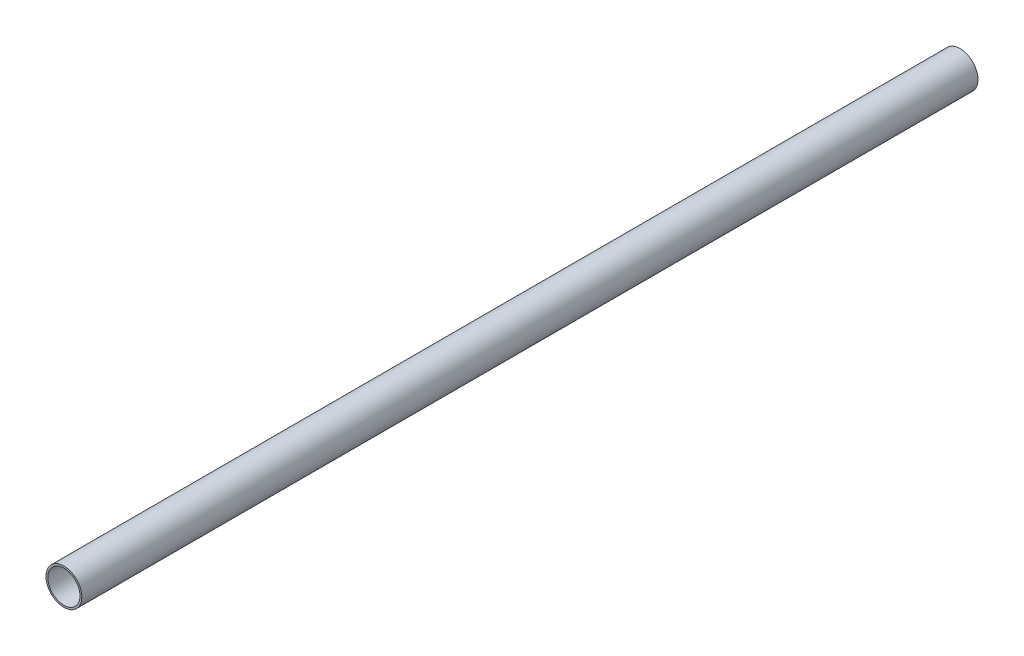
ISO-10303-21;
HEADER;
FILE_DESCRIPTION(('STEP AP214'),'2;1');
FILE_NAME('part.step','',(''),(''),'','','');
FILE_SCHEMA(('AUTOMOTIVE_DESIGN { 1 0 10303 214 1 1 1 1 }'));
ENDSEC;
DATA;
#1=APPLICATION_CONTEXT('core data for automotive mechanical design processes');
#2=APPLICATION_PROTOCOL_DEFINITION('international standard','automotive_design',2000,#1);
#3=PRODUCT_CONTEXT('',#1,'mechanical');
#4=PRODUCT('Part','Part','',(#3));
#5=PRODUCT_RELATED_PRODUCT_CATEGORY('part','',(#4));
#6=PRODUCT_DEFINITION_FORMATION('','',#4);
#7=PRODUCT_DEFINITION_CONTEXT('part definition',#1,'design');
#8=PRODUCT_DEFINITION('design','',#6,#7);
#9=PRODUCT_DEFINITION_SHAPE('','',#8);
#10=(LENGTH_UNIT() NAMED_UNIT(*) SI_UNIT(.MILLI.,.METRE.));
#11=(NAMED_UNIT(*) PLANE_ANGLE_UNIT() SI_UNIT($,.RADIAN.));
#12=(NAMED_UNIT(*) SI_UNIT($,.STERADIAN.) SOLID_ANGLE_UNIT());
#13=UNCERTAINTY_MEASURE_WITH_UNIT(LENGTH_MEASURE(1.E-05),#10,'distance_accuracy_value','');
#14=(GEOMETRIC_REPRESENTATION_CONTEXT(3) GLOBAL_UNCERTAINTY_ASSIGNED_CONTEXT((#13)) GLOBAL_UNIT_ASSIGNED_CONTEXT((#10,
#11,#12)) REPRESENTATION_CONTEXT('',''));
#15=CARTESIAN_POINT('',(0.,0.,0.));
#16=DIRECTION('',(0.,0.,1.));
#17=DIRECTION('',(1.,0.,0.));
#18=AXIS2_PLACEMENT_3D('',#15,#16,#17);
#19=CARTESIAN_POINT('',(0.,0.,1000.));
#20=DIRECTION('',(0.,0.,1.));
#21=DIRECTION('',(1.,0.,0.));
#22=AXIS2_PLACEMENT_3D('',#19,#20,#21);
#23=PLANE('',#22);
#24=CARTESIAN_POINT('',(0.,0.,1000.));
#25=DIRECTION('',(0.,0.,1.));
#26=DIRECTION('',(1.,0.,0.));
#27=AXIS2_PLACEMENT_3D('',#24,#25,#26);
#28=CIRCLE('',#27,20.);
#29=CARTESIAN_POINT('',(20.,0.,1000.));
#30=VERTEX_POINT('',#29);
#31=EDGE_CURVE('E10',#30,#30,#28,.T.);
#32=ORIENTED_EDGE('',*,*,#31,.T.);
#33=EDGE_LOOP('',(#32));
#34=FACE_BOUND('',#33,.T.);
#35=CARTESIAN_POINT('',(0.,0.,1000.));
#36=DIRECTION('',(0.,0.,1.));
#37=DIRECTION('',(1.,0.,0.));
#38=AXIS2_PLACEMENT_3D('',#35,#36,#37);
#39=CIRCLE('',#38,18.);
#40=CARTESIAN_POINT('',(18.,0.,1000.));
#41=VERTEX_POINT('',#40);
#42=EDGE_CURVE('E45',#41,#41,#39,.T.);
#43=ORIENTED_EDGE('',*,*,#42,.F.);
#44=EDGE_LOOP('',(#43));
#45=FACE_BOUND('',#44,.T.);
#46=ADVANCED_FACE('F34',(#34,#45),#23,.T.);
#47=CARTESIAN_POINT('',(0.,0.,0.));
#48=DIRECTION('',(0.,0.,1.));
#49=DIRECTION('',(1.,0.,0.));
#50=AXIS2_PLACEMENT_3D('',#47,#48,#49);
#51=PLANE('',#50);
#52=CARTESIAN_POINT('',(0.,0.,0.));
#53=DIRECTION('',(0.,0.,1.));
#54=DIRECTION('',(1.,0.,0.));
#55=AXIS2_PLACEMENT_3D('',#52,#53,#54);
#56=CIRCLE('',#55,20.);
#57=CARTESIAN_POINT('',(20.,0.,0.));
#58=VERTEX_POINT('',#57);
#59=EDGE_CURVE('E38',#58,#58,#56,.T.);
#60=ORIENTED_EDGE('',*,*,#59,.F.);
#61=EDGE_LOOP('',(#60));
#62=FACE_BOUND('',#61,.T.);
#63=CARTESIAN_POINT('',(0.,0.,0.));
#64=DIRECTION('',(0.,0.,1.));
#65=DIRECTION('',(1.,0.,0.));
#66=AXIS2_PLACEMENT_3D('',#63,#64,#65);
#67=CIRCLE('',#66,18.);
#68=CARTESIAN_POINT('',(18.,0.,0.));
#69=VERTEX_POINT('',#68);
#70=EDGE_CURVE('E47',#69,#69,#67,.T.);
#71=ORIENTED_EDGE('',*,*,#70,.T.);
#72=EDGE_LOOP('',(#71));
#73=FACE_BOUND('',#72,.T.);
#74=ADVANCED_FACE('F57',(#62,#73),#51,.F.);
#75=CARTESIAN_POINT('',(0.,0.,1000.));
#76=DIRECTION('',(0.,0.,-1.));
#77=DIRECTION('',(-1.,0.,0.));
#78=AXIS2_PLACEMENT_3D('',#75,#76,#77);
#79=CYLINDRICAL_SURFACE('',#78,20.);
#80=ORIENTED_EDGE('',*,*,#31,.F.);
#81=EDGE_LOOP('',(#80));
#82=FACE_BOUND('',#81,.T.);
#83=ORIENTED_EDGE('',*,*,#59,.T.);
#84=EDGE_LOOP('',(#83));
#85=FACE_BOUND('',#84,.T.);
#86=ADVANCED_FACE('F36',(#82,#85),#79,.T.);
#87=CARTESIAN_POINT('',(0.,0.,1000.));
#88=DIRECTION('',(0.,0.,-1.));
#89=DIRECTION('',(-1.,0.,0.));
#90=AXIS2_PLACEMENT_3D('',#87,#88,#89);
#91=CYLINDRICAL_SURFACE('',#90,18.);
#92=ORIENTED_EDGE('',*,*,#42,.T.);
#93=EDGE_LOOP('',(#92));
#94=FACE_BOUND('',#93,.T.);
#95=ORIENTED_EDGE('',*,*,#70,.F.);
#96=EDGE_LOOP('',(#95));
#97=FACE_BOUND('',#96,.T.);
#98=ADVANCED_FACE('F53',(#94,#97),#91,.F.);
#99=CLOSED_SHELL('',(#46,#74,#86,#98));
#100=MANIFOLD_SOLID_BREP('B2',#99);
#101=ADVANCED_BREP_SHAPE_REPRESENTATION('',(#18,#100),#14);
#102=SHAPE_DEFINITION_REPRESENTATION(#9,#101);
ENDSEC;
END-ISO-10303-21;
